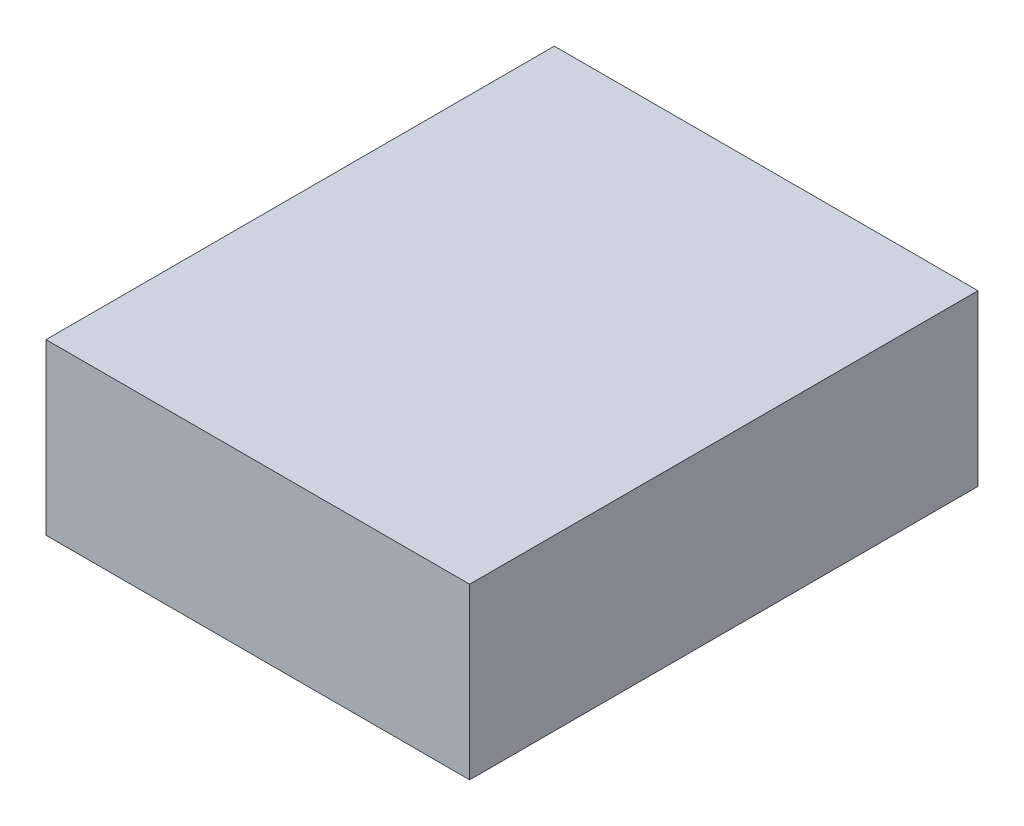
ISO-10303-21;
HEADER;
FILE_DESCRIPTION(('STEP AP214'),'2;1');
FILE_NAME('part.step','',(''),(''),'','','');
FILE_SCHEMA(('AUTOMOTIVE_DESIGN { 1 0 10303 214 1 1 1 1 }'));
ENDSEC;
DATA;
#1=APPLICATION_CONTEXT('core data for automotive mechanical design processes');
#2=APPLICATION_PROTOCOL_DEFINITION('international standard','automotive_design',2000,#1);
#3=PRODUCT_CONTEXT('',#1,'mechanical');
#4=PRODUCT('Part','Part','',(#3));
#5=PRODUCT_RELATED_PRODUCT_CATEGORY('part','',(#4));
#6=PRODUCT_DEFINITION_FORMATION('','',#4);
#7=PRODUCT_DEFINITION_CONTEXT('part definition',#1,'design');
#8=PRODUCT_DEFINITION('design','',#6,#7);
#9=PRODUCT_DEFINITION_SHAPE('','',#8);
#10=(LENGTH_UNIT() NAMED_UNIT(*) SI_UNIT(.MILLI.,.METRE.));
#11=(NAMED_UNIT(*) PLANE_ANGLE_UNIT() SI_UNIT($,.RADIAN.));
#12=(NAMED_UNIT(*) SI_UNIT($,.STERADIAN.) SOLID_ANGLE_UNIT());
#13=UNCERTAINTY_MEASURE_WITH_UNIT(LENGTH_MEASURE(1.E-05),#10,'distance_accuracy_value','');
#14=(GEOMETRIC_REPRESENTATION_CONTEXT(3) GLOBAL_UNCERTAINTY_ASSIGNED_CONTEXT((#13)) GLOBAL_UNIT_ASSIGNED_CONTEXT((#10,
#11,#12)) REPRESENTATION_CONTEXT('',''));
#15=CARTESIAN_POINT('',(0.,0.,0.));
#16=DIRECTION('',(0.,0.,1.));
#17=DIRECTION('',(1.,0.,0.));
#18=AXIS2_PLACEMENT_3D('',#15,#16,#17);
#19=CARTESIAN_POINT('',(0.,1.,0.));
#20=DIRECTION('',(1.,0.,0.));
#21=DIRECTION('',(0.,0.,-1.));
#22=AXIS2_PLACEMENT_3D('',#19,#20,#21);
#23=PLANE('',#22);
#24=DIRECTION('',(0.,0.,1.));
#25=VECTOR('',#24,1.);
#26=CARTESIAN_POINT('',(0.,0.,0.));
#27=LINE('',#26,#25);
#28=CARTESIAN_POINT('',(0.,0.,-3.));
#29=VERTEX_POINT('',#28);
#30=CARTESIAN_POINT('',(0.,0.,0.));
#31=VERTEX_POINT('',#30);
#32=EDGE_CURVE('E100',#29,#31,#27,.T.);
#33=ORIENTED_EDGE('',*,*,#32,.T.);
#34=DIRECTION('',(0.,-1.,0.));
#35=VECTOR('',#34,1.);
#36=CARTESIAN_POINT('',(0.,1.,0.));
#37=LINE('',#36,#35);
#38=CARTESIAN_POINT('',(0.,1.,0.));
#39=VERTEX_POINT('',#38);
#40=EDGE_CURVE('E11',#39,#31,#37,.T.);
#41=ORIENTED_EDGE('',*,*,#40,.F.);
#42=DIRECTION('',(0.,0.,1.));
#43=VECTOR('',#42,1.);
#44=CARTESIAN_POINT('',(0.,1.,0.));
#45=LINE('',#44,#43);
#46=CARTESIAN_POINT('',(0.,1.,-3.));
#47=VERTEX_POINT('',#46);
#48=EDGE_CURVE('E88',#47,#39,#45,.T.);
#49=ORIENTED_EDGE('',*,*,#48,.F.);
#50=DIRECTION('',(0.,-1.,0.));
#51=VECTOR('',#50,1.);
#52=CARTESIAN_POINT('',(0.,1.,-3.));
#53=LINE('',#52,#51);
#54=EDGE_CURVE('E96',#47,#29,#53,.T.);
#55=ORIENTED_EDGE('',*,*,#54,.T.);
#56=EDGE_LOOP('',(#33,#41,#49,#55));
#57=FACE_BOUND('',#56,.T.);
#58=ADVANCED_FACE('F37',(#57),#23,.F.);
#59=CARTESIAN_POINT('',(0.,1.,0.));
#60=DIRECTION('',(0.,0.,-1.));
#61=DIRECTION('',(-1.,0.,0.));
#62=AXIS2_PLACEMENT_3D('',#59,#60,#61);
#63=PLANE('',#62);
#64=DIRECTION('',(1.,0.,0.));
#65=VECTOR('',#64,1.);
#66=CARTESIAN_POINT('',(0.,0.,0.));
#67=LINE('',#66,#65);
#68=CARTESIAN_POINT('',(2.5,0.,0.));
#69=VERTEX_POINT('',#68);
#70=EDGE_CURVE('E92',#31,#69,#67,.T.);
#71=ORIENTED_EDGE('',*,*,#70,.T.);
#72=DIRECTION('',(0.,-1.,0.));
#73=VECTOR('',#72,1.);
#74=CARTESIAN_POINT('',(2.5,1.,0.));
#75=LINE('',#74,#73);
#76=CARTESIAN_POINT('',(2.5,1.,0.));
#77=VERTEX_POINT('',#76);
#78=EDGE_CURVE('E45',#77,#69,#75,.T.);
#79=ORIENTED_EDGE('',*,*,#78,.F.);
#80=DIRECTION('',(1.,0.,0.));
#81=VECTOR('',#80,1.);
#82=CARTESIAN_POINT('',(0.,1.,0.));
#83=LINE('',#82,#81);
#84=EDGE_CURVE('E83',#39,#77,#83,.T.);
#85=ORIENTED_EDGE('',*,*,#84,.F.);
#86=ORIENTED_EDGE('',*,*,#40,.T.);
#87=EDGE_LOOP('',(#71,#79,#85,#86));
#88=FACE_BOUND('',#87,.T.);
#89=ADVANCED_FACE('F91',(#88),#63,.F.);
#90=CARTESIAN_POINT('',(2.5,1.,0.));
#91=DIRECTION('',(-1.,0.,0.));
#92=DIRECTION('',(0.,0.,1.));
#93=AXIS2_PLACEMENT_3D('',#90,#91,#92);
#94=PLANE('',#93);
#95=DIRECTION('',(0.,0.,-1.));
#96=VECTOR('',#95,1.);
#97=CARTESIAN_POINT('',(2.5,0.,0.));
#98=LINE('',#97,#96);
#99=CARTESIAN_POINT('',(2.5,0.,-3.));
#100=VERTEX_POINT('',#99);
#101=EDGE_CURVE('E70',#69,#100,#98,.T.);
#102=ORIENTED_EDGE('',*,*,#101,.T.);
#103=DIRECTION('',(0.,-1.,0.));
#104=VECTOR('',#103,1.);
#105=CARTESIAN_POINT('',(2.5,1.,-3.));
#106=LINE('',#105,#104);
#107=CARTESIAN_POINT('',(2.5,1.,-3.));
#108=VERTEX_POINT('',#107);
#109=EDGE_CURVE('E93',#108,#100,#106,.T.);
#110=ORIENTED_EDGE('',*,*,#109,.F.);
#111=DIRECTION('',(0.,0.,-1.));
#112=VECTOR('',#111,1.);
#113=CARTESIAN_POINT('',(2.5,1.,0.));
#114=LINE('',#113,#112);
#115=EDGE_CURVE('E86',#77,#108,#114,.T.);
#116=ORIENTED_EDGE('',*,*,#115,.F.);
#117=ORIENTED_EDGE('',*,*,#78,.T.);
#118=EDGE_LOOP('',(#102,#110,#116,#117));
#119=FACE_BOUND('',#118,.T.);
#120=ADVANCED_FACE('F94',(#119),#94,.F.);
#121=CARTESIAN_POINT('',(0.,1.,-3.));
#122=DIRECTION('',(0.,0.,1.));
#123=DIRECTION('',(1.,0.,0.));
#124=AXIS2_PLACEMENT_3D('',#121,#122,#123);
#125=PLANE('',#124);
#126=DIRECTION('',(-1.,0.,0.));
#127=VECTOR('',#126,1.);
#128=CARTESIAN_POINT('',(0.,0.,-3.));
#129=LINE('',#128,#127);
#130=EDGE_CURVE('E76',#100,#29,#129,.T.);
#131=ORIENTED_EDGE('',*,*,#130,.T.);
#132=ORIENTED_EDGE('',*,*,#54,.F.);
#133=DIRECTION('',(-1.,0.,0.));
#134=VECTOR('',#133,1.);
#135=CARTESIAN_POINT('',(0.,1.,-3.));
#136=LINE('',#135,#134);
#137=EDGE_CURVE('E53',#108,#47,#136,.T.);
#138=ORIENTED_EDGE('',*,*,#137,.F.);
#139=ORIENTED_EDGE('',*,*,#109,.T.);
#140=EDGE_LOOP('',(#131,#132,#138,#139));
#141=FACE_BOUND('',#140,.T.);
#142=ADVANCED_FACE('F107',(#141),#125,.F.);
#143=CARTESIAN_POINT('',(0.,1.,0.));
#144=DIRECTION('',(0.,-1.,0.));
#145=DIRECTION('',(0.,0.,-1.));
#146=AXIS2_PLACEMENT_3D('',#143,#144,#145);
#147=PLANE('',#146);
#148=ORIENTED_EDGE('',*,*,#48,.T.);
#149=ORIENTED_EDGE('',*,*,#84,.T.);
#150=ORIENTED_EDGE('',*,*,#115,.T.);
#151=ORIENTED_EDGE('',*,*,#137,.T.);
#152=EDGE_LOOP('',(#148,#149,#150,#151));
#153=FACE_BOUND('',#152,.T.);
#154=ADVANCED_FACE('F84',(#153),#147,.F.);
#155=CARTESIAN_POINT('',(0.,0.,0.));
#156=DIRECTION('',(0.,-1.,0.));
#157=DIRECTION('',(0.,0.,-1.));
#158=AXIS2_PLACEMENT_3D('',#155,#156,#157);
#159=PLANE('',#158);
#160=ORIENTED_EDGE('',*,*,#32,.F.);
#161=ORIENTED_EDGE('',*,*,#130,.F.);
#162=ORIENTED_EDGE('',*,*,#101,.F.);
#163=ORIENTED_EDGE('',*,*,#70,.F.);
#164=EDGE_LOOP('',(#160,#161,#162,#163));
#165=FACE_BOUND('',#164,.T.);
#166=ADVANCED_FACE('F110',(#165),#159,.T.);
#167=CLOSED_SHELL('',(#58,#89,#120,#142,#154,#166));
#168=MANIFOLD_SOLID_BREP('B2',#167);
#169=ADVANCED_BREP_SHAPE_REPRESENTATION('',(#18,#168),#14);
#170=SHAPE_DEFINITION_REPRESENTATION(#9,#169);
ENDSEC;
END-ISO-10303-21;
